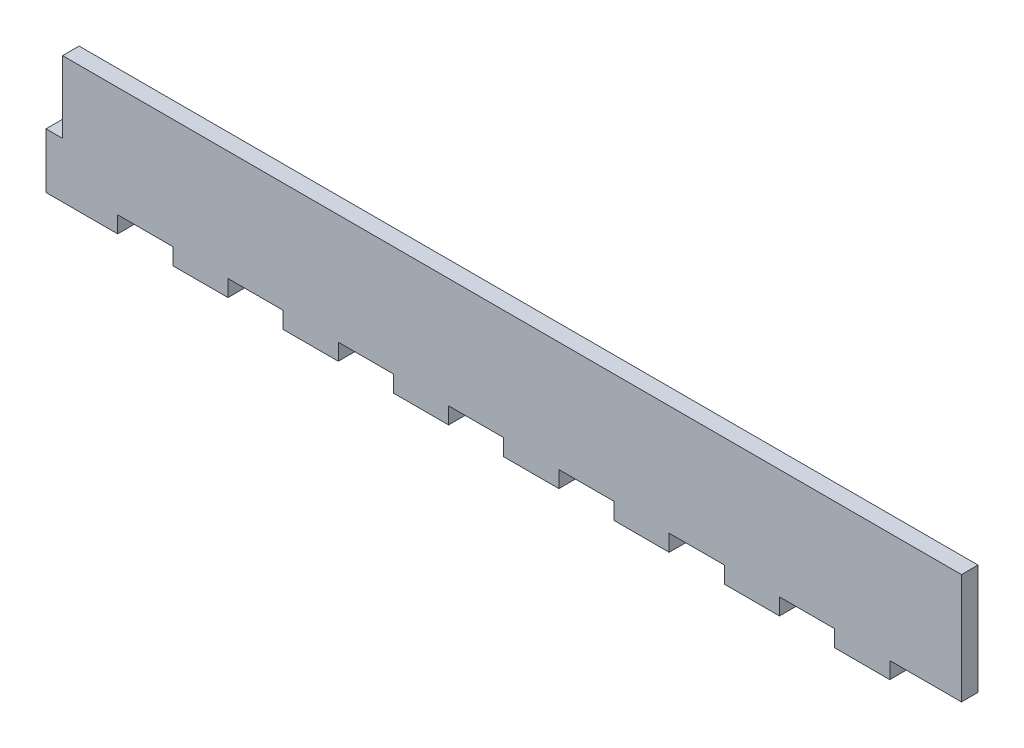
ISO-10303-21;
HEADER;
FILE_DESCRIPTION(('STEP AP214'),'2;1');
FILE_NAME('part.step','',(''),(''),'','','');
FILE_SCHEMA(('AUTOMOTIVE_DESIGN { 1 0 10303 214 1 1 1 1 }'));
ENDSEC;
DATA;
#1=APPLICATION_CONTEXT('core data for automotive mechanical design processes');
#2=APPLICATION_PROTOCOL_DEFINITION('international standard','automotive_design',2000,#1);
#3=PRODUCT_CONTEXT('',#1,'mechanical');
#4=PRODUCT('Part','Part','',(#3));
#5=PRODUCT_RELATED_PRODUCT_CATEGORY('part','',(#4));
#6=PRODUCT_DEFINITION_FORMATION('','',#4);
#7=PRODUCT_DEFINITION_CONTEXT('part definition',#1,'design');
#8=PRODUCT_DEFINITION('design','',#6,#7);
#9=PRODUCT_DEFINITION_SHAPE('','',#8);
#10=(LENGTH_UNIT() NAMED_UNIT(*) SI_UNIT(.MILLI.,.METRE.));
#11=(NAMED_UNIT(*) PLANE_ANGLE_UNIT() SI_UNIT($,.RADIAN.));
#12=(NAMED_UNIT(*) SI_UNIT($,.STERADIAN.) SOLID_ANGLE_UNIT());
#13=UNCERTAINTY_MEASURE_WITH_UNIT(LENGTH_MEASURE(1.E-05),#10,'distance_accuracy_value','');
#14=(GEOMETRIC_REPRESENTATION_CONTEXT(3) GLOBAL_UNCERTAINTY_ASSIGNED_CONTEXT((#13)) GLOBAL_UNIT_ASSIGNED_CONTEXT((#10,
#11,#12)) REPRESENTATION_CONTEXT('',''));
#15=CARTESIAN_POINT('',(0.,0.,0.));
#16=DIRECTION('',(0.,0.,1.));
#17=DIRECTION('',(1.,0.,0.));
#18=AXIS2_PLACEMENT_3D('',#15,#16,#17);
#19=CARTESIAN_POINT('',(0.,0.,3.));
#20=DIRECTION('',(1.,0.,0.));
#21=DIRECTION('',(0.,1.,0.));
#22=AXIS2_PLACEMENT_3D('',#19,#20,#21);
#23=PLANE('',#22);
#24=DIRECTION('',(0.,0.,-1.));
#25=VECTOR('',#24,1.);
#26=CARTESIAN_POINT('',(0.,-13.,0.));
#27=LINE('',#26,#25);
#28=CARTESIAN_POINT('',(0.,-13.,3.));
#29=VERTEX_POINT('',#28);
#30=CARTESIAN_POINT('',(0.,-13.,0.));
#31=VERTEX_POINT('',#30);
#32=EDGE_CURVE('E49',#29,#31,#27,.T.);
#33=ORIENTED_EDGE('',*,*,#32,.F.);
#34=DIRECTION('',(0.,-1.,0.));
#35=VECTOR('',#34,1.);
#36=CARTESIAN_POINT('',(0.,0.,3.));
#37=LINE('',#36,#35);
#38=CARTESIAN_POINT('',(0.,0.,3.));
#39=VERTEX_POINT('',#38);
#40=EDGE_CURVE('E504',#39,#29,#37,.T.);
#41=ORIENTED_EDGE('',*,*,#40,.F.);
#42=DIRECTION('',(0.,0.,-1.));
#43=VECTOR('',#42,1.);
#44=CARTESIAN_POINT('',(0.,0.,3.));
#45=LINE('',#44,#43);
#46=CARTESIAN_POINT('',(0.,0.,0.));
#47=VERTEX_POINT('',#46);
#48=EDGE_CURVE('E515',#39,#47,#45,.T.);
#49=ORIENTED_EDGE('',*,*,#48,.T.);
#50=DIRECTION('',(0.,-1.,0.));
#51=VECTOR('',#50,1.);
#52=CARTESIAN_POINT('',(0.,0.,0.));
#53=LINE('',#52,#51);
#54=EDGE_CURVE('E503',#47,#31,#53,.T.);
#55=ORIENTED_EDGE('',*,*,#54,.T.);
#56=EDGE_LOOP('',(#33,#41,#49,#55));
#57=FACE_BOUND('',#56,.T.);
#58=ADVANCED_FACE('F35',(#57),#23,.F.);
#59=CARTESIAN_POINT('',(0.,-20.,3.));
#60=DIRECTION('',(0.,1.,0.));
#61=DIRECTION('',(0.,0.,1.));
#62=AXIS2_PLACEMENT_3D('',#59,#60,#61);
#63=PLANE('',#62);
#64=DIRECTION('',(0.,0.,-1.));
#65=VECTOR('',#64,1.);
#66=CARTESIAN_POINT('',(140.,-20.,3.));
#67=LINE('',#66,#65);
#68=CARTESIAN_POINT('',(140.,-20.,3.));
#69=VERTEX_POINT('',#68);
#70=CARTESIAN_POINT('',(140.,-20.,0.));
#71=VERTEX_POINT('',#70);
#72=EDGE_CURVE('E307',#69,#71,#67,.T.);
#73=ORIENTED_EDGE('',*,*,#72,.F.);
#74=DIRECTION('',(1.,0.,0.));
#75=VECTOR('',#74,1.);
#76=CARTESIAN_POINT('',(0.,-20.,3.));
#77=LINE('',#76,#75);
#78=CARTESIAN_POINT('',(130.,-20.,3.));
#79=VERTEX_POINT('',#78);
#80=EDGE_CURVE('E583',#79,#69,#77,.T.);
#81=ORIENTED_EDGE('',*,*,#80,.F.);
#82=DIRECTION('',(0.,0.,1.));
#83=VECTOR('',#82,1.);
#84=CARTESIAN_POINT('',(130.,-20.,3.));
#85=LINE('',#84,#83);
#86=CARTESIAN_POINT('',(130.,-20.,0.));
#87=VERTEX_POINT('',#86);
#88=EDGE_CURVE('E338',#87,#79,#85,.T.);
#89=ORIENTED_EDGE('',*,*,#88,.F.);
#90=DIRECTION('',(1.,0.,0.));
#91=VECTOR('',#90,1.);
#92=CARTESIAN_POINT('',(0.,-20.,0.));
#93=LINE('',#92,#91);
#94=EDGE_CURVE('E543',#87,#71,#93,.T.);
#95=ORIENTED_EDGE('',*,*,#94,.T.);
#96=EDGE_LOOP('',(#73,#81,#89,#95));
#97=FACE_BOUND('',#96,.T.);
#98=ADVANCED_FACE('F602',(#97),#63,.F.);
#99=DIRECTION('',(0.,0.,1.));
#100=VECTOR('',#99,1.);
#101=CARTESIAN_POINT('',(150.,-20.,3.));
#102=LINE('',#101,#100);
#103=CARTESIAN_POINT('',(150.,-20.,0.));
#104=VERTEX_POINT('',#103);
#105=CARTESIAN_POINT('',(150.,-20.,3.));
#106=VERTEX_POINT('',#105);
#107=EDGE_CURVE('E312',#104,#106,#102,.T.);
#108=ORIENTED_EDGE('',*,*,#107,.F.);
#109=CARTESIAN_POINT('',(163.,-20.,0.));
#110=VERTEX_POINT('',#109);
#111=EDGE_CURVE('E517',#104,#110,#93,.T.);
#112=ORIENTED_EDGE('',*,*,#111,.T.);
#113=DIRECTION('',(0.,0.,-1.));
#114=VECTOR('',#113,1.);
#115=CARTESIAN_POINT('',(163.,-20.,3.));
#116=LINE('',#115,#114);
#117=CARTESIAN_POINT('',(163.,-20.,3.));
#118=VERTEX_POINT('',#117);
#119=EDGE_CURVE('E11',#118,#110,#116,.T.);
#120=ORIENTED_EDGE('',*,*,#119,.F.);
#121=EDGE_CURVE('E57',#106,#118,#77,.T.);
#122=ORIENTED_EDGE('',*,*,#121,.F.);
#123=EDGE_LOOP('',(#108,#112,#120,#122));
#124=FACE_BOUND('',#123,.T.);
#125=ADVANCED_FACE('F541',(#124),#63,.F.);
#126=DIRECTION('',(0.,0.,-1.));
#127=VECTOR('',#126,1.);
#128=CARTESIAN_POINT('',(120.,-20.,3.));
#129=LINE('',#128,#127);
#130=CARTESIAN_POINT('',(120.,-20.,3.));
#131=VERTEX_POINT('',#130);
#132=CARTESIAN_POINT('',(120.,-20.,0.));
#133=VERTEX_POINT('',#132);
#134=EDGE_CURVE('E333',#131,#133,#129,.T.);
#135=ORIENTED_EDGE('',*,*,#134,.F.);
#136=CARTESIAN_POINT('',(110.,-20.,3.));
#137=VERTEX_POINT('',#136);
#138=EDGE_CURVE('E580',#137,#131,#77,.T.);
#139=ORIENTED_EDGE('',*,*,#138,.F.);
#140=DIRECTION('',(0.,0.,1.));
#141=VECTOR('',#140,1.);
#142=CARTESIAN_POINT('',(110.,-20.,3.));
#143=LINE('',#142,#141);
#144=CARTESIAN_POINT('',(110.,-20.,0.));
#145=VERTEX_POINT('',#144);
#146=EDGE_CURVE('E365',#145,#137,#143,.T.);
#147=ORIENTED_EDGE('',*,*,#146,.F.);
#148=EDGE_CURVE('E544',#145,#133,#93,.T.);
#149=ORIENTED_EDGE('',*,*,#148,.T.);
#150=EDGE_LOOP('',(#135,#139,#147,#149));
#151=FACE_BOUND('',#150,.T.);
#152=ADVANCED_FACE('F612',(#151),#63,.F.);
#153=DIRECTION('',(0.,0.,-1.));
#154=VECTOR('',#153,1.);
#155=CARTESIAN_POINT('',(100.,-20.,3.));
#156=LINE('',#155,#154);
#157=CARTESIAN_POINT('',(100.,-20.,3.));
#158=VERTEX_POINT('',#157);
#159=CARTESIAN_POINT('',(100.,-20.,0.));
#160=VERTEX_POINT('',#159);
#161=EDGE_CURVE('E360',#158,#160,#156,.T.);
#162=ORIENTED_EDGE('',*,*,#161,.F.);
#163=CARTESIAN_POINT('',(90.,-20.,3.));
#164=VERTEX_POINT('',#163);
#165=EDGE_CURVE('E577',#164,#158,#77,.T.);
#166=ORIENTED_EDGE('',*,*,#165,.F.);
#167=DIRECTION('',(0.,0.,1.));
#168=VECTOR('',#167,1.);
#169=CARTESIAN_POINT('',(90.,-20.,3.));
#170=LINE('',#169,#168);
#171=CARTESIAN_POINT('',(90.,-20.,0.));
#172=VERTEX_POINT('',#171);
#173=EDGE_CURVE('E392',#172,#164,#170,.T.);
#174=ORIENTED_EDGE('',*,*,#173,.F.);
#175=EDGE_CURVE('E547',#172,#160,#93,.T.);
#176=ORIENTED_EDGE('',*,*,#175,.T.);
#177=EDGE_LOOP('',(#162,#166,#174,#176));
#178=FACE_BOUND('',#177,.T.);
#179=ADVANCED_FACE('F625',(#178),#63,.F.);
#180=DIRECTION('',(0.,0.,-1.));
#181=VECTOR('',#180,1.);
#182=CARTESIAN_POINT('',(80.,-20.,3.));
#183=LINE('',#182,#181);
#184=CARTESIAN_POINT('',(80.,-20.,3.));
#185=VERTEX_POINT('',#184);
#186=CARTESIAN_POINT('',(80.,-20.,0.));
#187=VERTEX_POINT('',#186);
#188=EDGE_CURVE('E387',#185,#187,#183,.T.);
#189=ORIENTED_EDGE('',*,*,#188,.F.);
#190=CARTESIAN_POINT('',(70.,-20.,3.));
#191=VERTEX_POINT('',#190);
#192=EDGE_CURVE('E574',#191,#185,#77,.T.);
#193=ORIENTED_EDGE('',*,*,#192,.F.);
#194=DIRECTION('',(0.,0.,1.));
#195=VECTOR('',#194,1.);
#196=CARTESIAN_POINT('',(70.,-20.,3.));
#197=LINE('',#196,#195);
#198=CARTESIAN_POINT('',(70.,-20.,0.));
#199=VERTEX_POINT('',#198);
#200=EDGE_CURVE('E419',#199,#191,#197,.T.);
#201=ORIENTED_EDGE('',*,*,#200,.F.);
#202=EDGE_CURVE('E550',#199,#187,#93,.T.);
#203=ORIENTED_EDGE('',*,*,#202,.T.);
#204=EDGE_LOOP('',(#189,#193,#201,#203));
#205=FACE_BOUND('',#204,.T.);
#206=ADVANCED_FACE('F638',(#205),#63,.F.);
#207=DIRECTION('',(0.,0.,-1.));
#208=VECTOR('',#207,1.);
#209=CARTESIAN_POINT('',(60.,-20.,3.));
#210=LINE('',#209,#208);
#211=CARTESIAN_POINT('',(60.,-20.,3.));
#212=VERTEX_POINT('',#211);
#213=CARTESIAN_POINT('',(60.,-20.,0.));
#214=VERTEX_POINT('',#213);
#215=EDGE_CURVE('E414',#212,#214,#210,.T.);
#216=ORIENTED_EDGE('',*,*,#215,.F.);
#217=CARTESIAN_POINT('',(50.,-20.,3.));
#218=VERTEX_POINT('',#217);
#219=EDGE_CURVE('E572',#218,#212,#77,.T.);
#220=ORIENTED_EDGE('',*,*,#219,.F.);
#221=DIRECTION('',(0.,0.,1.));
#222=VECTOR('',#221,1.);
#223=CARTESIAN_POINT('',(50.,-20.,3.));
#224=LINE('',#223,#222);
#225=CARTESIAN_POINT('',(50.,-20.,0.));
#226=VERTEX_POINT('',#225);
#227=EDGE_CURVE('E446',#226,#218,#224,.T.);
#228=ORIENTED_EDGE('',*,*,#227,.F.);
#229=EDGE_CURVE('E553',#226,#214,#93,.T.);
#230=ORIENTED_EDGE('',*,*,#229,.T.);
#231=EDGE_LOOP('',(#216,#220,#228,#230));
#232=FACE_BOUND('',#231,.T.);
#233=ADVANCED_FACE('F650',(#232),#63,.F.);
#234=DIRECTION('',(0.,0.,-1.));
#235=VECTOR('',#234,1.);
#236=CARTESIAN_POINT('',(40.,-20.,3.));
#237=LINE('',#236,#235);
#238=CARTESIAN_POINT('',(40.,-20.,3.));
#239=VERTEX_POINT('',#238);
#240=CARTESIAN_POINT('',(40.,-20.,0.));
#241=VERTEX_POINT('',#240);
#242=EDGE_CURVE('E441',#239,#241,#237,.T.);
#243=ORIENTED_EDGE('',*,*,#242,.F.);
#244=CARTESIAN_POINT('',(30.,-20.,3.));
#245=VERTEX_POINT('',#244);
#246=EDGE_CURVE('E511',#245,#239,#77,.T.);
#247=ORIENTED_EDGE('',*,*,#246,.F.);
#248=DIRECTION('',(0.,0.,1.));
#249=VECTOR('',#248,1.);
#250=CARTESIAN_POINT('',(30.,-20.,3.));
#251=LINE('',#250,#249);
#252=CARTESIAN_POINT('',(30.,-20.,0.));
#253=VERTEX_POINT('',#252);
#254=EDGE_CURVE('E473',#253,#245,#251,.T.);
#255=ORIENTED_EDGE('',*,*,#254,.F.);
#256=EDGE_CURVE('E521',#253,#241,#93,.T.);
#257=ORIENTED_EDGE('',*,*,#256,.T.);
#258=EDGE_LOOP('',(#243,#247,#255,#257));
#259=FACE_BOUND('',#258,.T.);
#260=ADVANCED_FACE('F560',(#259),#63,.F.);
#261=DIRECTION('',(0.,0.,-1.));
#262=VECTOR('',#261,1.);
#263=CARTESIAN_POINT('',(20.,-20.,3.));
#264=LINE('',#263,#262);
#265=CARTESIAN_POINT('',(20.,-20.,3.));
#266=VERTEX_POINT('',#265);
#267=CARTESIAN_POINT('',(20.,-20.,0.));
#268=VERTEX_POINT('',#267);
#269=EDGE_CURVE('E468',#266,#268,#264,.T.);
#270=ORIENTED_EDGE('',*,*,#269,.F.);
#271=CARTESIAN_POINT('',(10.,-20.,3.));
#272=VERTEX_POINT('',#271);
#273=EDGE_CURVE('E507',#272,#266,#77,.T.);
#274=ORIENTED_EDGE('',*,*,#273,.F.);
#275=DIRECTION('',(0.,0.,1.));
#276=VECTOR('',#275,1.);
#277=CARTESIAN_POINT('',(10.,-20.,3.));
#278=LINE('',#277,#276);
#279=CARTESIAN_POINT('',(10.,-20.,0.));
#280=VERTEX_POINT('',#279);
#281=EDGE_CURVE('E282',#280,#272,#278,.T.);
#282=ORIENTED_EDGE('',*,*,#281,.F.);
#283=EDGE_CURVE('E518',#280,#268,#93,.T.);
#284=ORIENTED_EDGE('',*,*,#283,.T.);
#285=EDGE_LOOP('',(#270,#274,#282,#284));
#286=FACE_BOUND('',#285,.T.);
#287=ADVANCED_FACE('F671',(#286),#63,.F.);
#288=CARTESIAN_POINT('',(163.,0.,3.));
#289=DIRECTION('',(-1.,0.,0.));
#290=DIRECTION('',(0.,0.,1.));
#291=AXIS2_PLACEMENT_3D('',#288,#289,#290);
#292=PLANE('',#291);
#293=DIRECTION('',(0.,1.,0.));
#294=VECTOR('',#293,1.);
#295=CARTESIAN_POINT('',(163.,0.,0.));
#296=LINE('',#295,#294);
#297=CARTESIAN_POINT('',(163.,0.,0.));
#298=VERTEX_POINT('',#297);
#299=EDGE_CURVE('E520',#110,#298,#296,.T.);
#300=ORIENTED_EDGE('',*,*,#299,.T.);
#301=DIRECTION('',(0.,0.,-1.));
#302=VECTOR('',#301,1.);
#303=CARTESIAN_POINT('',(163.,0.,3.));
#304=LINE('',#303,#302);
#305=CARTESIAN_POINT('',(163.,0.,3.));
#306=VERTEX_POINT('',#305);
#307=EDGE_CURVE('E42',#306,#298,#304,.T.);
#308=ORIENTED_EDGE('',*,*,#307,.F.);
#309=DIRECTION('',(0.,1.,0.));
#310=VECTOR('',#309,1.);
#311=CARTESIAN_POINT('',(163.,0.,3.));
#312=LINE('',#311,#310);
#313=EDGE_CURVE('E510',#118,#306,#312,.T.);
#314=ORIENTED_EDGE('',*,*,#313,.F.);
#315=ORIENTED_EDGE('',*,*,#119,.T.);
#316=EDGE_LOOP('',(#300,#308,#314,#315));
#317=FACE_BOUND('',#316,.T.);
#318=ADVANCED_FACE('F540',(#317),#292,.F.);
#319=CARTESIAN_POINT('',(0.,0.,3.));
#320=DIRECTION('',(0.,-1.,0.));
#321=DIRECTION('',(0.,0.,-1.));
#322=AXIS2_PLACEMENT_3D('',#319,#320,#321);
#323=PLANE('',#322);
#324=DIRECTION('',(-1.,0.,0.));
#325=VECTOR('',#324,1.);
#326=CARTESIAN_POINT('',(0.,0.,0.));
#327=LINE('',#326,#325);
#328=EDGE_CURVE('E506',#298,#47,#327,.T.);
#329=ORIENTED_EDGE('',*,*,#328,.T.);
#330=ORIENTED_EDGE('',*,*,#48,.F.);
#331=DIRECTION('',(-1.,0.,0.));
#332=VECTOR('',#331,1.);
#333=CARTESIAN_POINT('',(0.,0.,3.));
#334=LINE('',#333,#332);
#335=EDGE_CURVE('E513',#306,#39,#334,.T.);
#336=ORIENTED_EDGE('',*,*,#335,.F.);
#337=ORIENTED_EDGE('',*,*,#307,.T.);
#338=EDGE_LOOP('',(#329,#330,#336,#337));
#339=FACE_BOUND('',#338,.T.);
#340=ADVANCED_FACE('F530',(#339),#323,.F.);
#341=CARTESIAN_POINT('',(0.,0.,3.));
#342=DIRECTION('',(0.,0.,1.));
#343=DIRECTION('',(1.,0.,0.));
#344=AXIS2_PLACEMENT_3D('',#341,#342,#343);
#345=PLANE('',#344);
#346=ORIENTED_EDGE('',*,*,#40,.T.);
#347=DIRECTION('',(1.,0.,0.));
#348=VECTOR('',#347,1.);
#349=CARTESIAN_POINT('',(-3.,-13.,3.));
#350=LINE('',#349,#348);
#351=CARTESIAN_POINT('',(-3.,-13.,3.));
#352=VERTEX_POINT('',#351);
#353=EDGE_CURVE('E304',#352,#29,#350,.T.);
#354=ORIENTED_EDGE('',*,*,#353,.F.);
#355=DIRECTION('',(0.,1.,0.));
#356=VECTOR('',#355,1.);
#357=CARTESIAN_POINT('',(-3.,-23.,3.));
#358=LINE('',#357,#356);
#359=CARTESIAN_POINT('',(-3.,-23.,3.));
#360=VERTEX_POINT('',#359);
#361=EDGE_CURVE('E291',#360,#352,#358,.T.);
#362=ORIENTED_EDGE('',*,*,#361,.F.);
#363=DIRECTION('',(-1.,0.,0.));
#364=VECTOR('',#363,1.);
#365=CARTESIAN_POINT('',(0.,-23.,3.));
#366=LINE('',#365,#364);
#367=CARTESIAN_POINT('',(10.,-23.,3.));
#368=VERTEX_POINT('',#367);
#369=EDGE_CURVE('E288',#368,#360,#366,.T.);
#370=ORIENTED_EDGE('',*,*,#369,.F.);
#371=DIRECTION('',(0.,1.,0.));
#372=VECTOR('',#371,1.);
#373=CARTESIAN_POINT('',(10.,-23.,3.));
#374=LINE('',#373,#372);
#375=EDGE_CURVE('E497',#368,#272,#374,.T.);
#376=ORIENTED_EDGE('',*,*,#375,.T.);
#377=ORIENTED_EDGE('',*,*,#273,.T.);
#378=DIRECTION('',(0.,1.,0.));
#379=VECTOR('',#378,1.);
#380=CARTESIAN_POINT('',(20.,-23.,3.));
#381=LINE('',#380,#379);
#382=CARTESIAN_POINT('',(20.,-23.,3.));
#383=VERTEX_POINT('',#382);
#384=EDGE_CURVE('E479',#383,#266,#381,.T.);
#385=ORIENTED_EDGE('',*,*,#384,.F.);
#386=DIRECTION('',(-1.,0.,0.));
#387=VECTOR('',#386,1.);
#388=CARTESIAN_POINT('',(20.,-23.,3.));
#389=LINE('',#388,#387);
#390=CARTESIAN_POINT('',(30.,-23.,3.));
#391=VERTEX_POINT('',#390);
#392=EDGE_CURVE('E477',#391,#383,#389,.T.);
#393=ORIENTED_EDGE('',*,*,#392,.F.);
#394=DIRECTION('',(0.,1.,0.));
#395=VECTOR('',#394,1.);
#396=CARTESIAN_POINT('',(30.,-23.,3.));
#397=LINE('',#396,#395);
#398=EDGE_CURVE('E486',#391,#245,#397,.T.);
#399=ORIENTED_EDGE('',*,*,#398,.T.);
#400=ORIENTED_EDGE('',*,*,#246,.T.);
#401=DIRECTION('',(0.,1.,0.));
#402=VECTOR('',#401,1.);
#403=CARTESIAN_POINT('',(40.,-23.,3.));
#404=LINE('',#403,#402);
#405=CARTESIAN_POINT('',(40.,-23.,3.));
#406=VERTEX_POINT('',#405);
#407=EDGE_CURVE('E452',#406,#239,#404,.T.);
#408=ORIENTED_EDGE('',*,*,#407,.F.);
#409=DIRECTION('',(-1.,0.,0.));
#410=VECTOR('',#409,1.);
#411=CARTESIAN_POINT('',(40.,-23.,3.));
#412=LINE('',#411,#410);
#413=CARTESIAN_POINT('',(50.,-23.,3.));
#414=VERTEX_POINT('',#413);
#415=EDGE_CURVE('E450',#414,#406,#412,.T.);
#416=ORIENTED_EDGE('',*,*,#415,.F.);
#417=DIRECTION('',(0.,1.,0.));
#418=VECTOR('',#417,1.);
#419=CARTESIAN_POINT('',(50.,-23.,3.));
#420=LINE('',#419,#418);
#421=EDGE_CURVE('E459',#414,#218,#420,.T.);
#422=ORIENTED_EDGE('',*,*,#421,.T.);
#423=ORIENTED_EDGE('',*,*,#219,.T.);
#424=DIRECTION('',(0.,1.,0.));
#425=VECTOR('',#424,1.);
#426=CARTESIAN_POINT('',(60.,-23.,3.));
#427=LINE('',#426,#425);
#428=CARTESIAN_POINT('',(60.,-23.,3.));
#429=VERTEX_POINT('',#428);
#430=EDGE_CURVE('E425',#429,#212,#427,.T.);
#431=ORIENTED_EDGE('',*,*,#430,.F.);
#432=DIRECTION('',(-1.,0.,0.));
#433=VECTOR('',#432,1.);
#434=CARTESIAN_POINT('',(60.,-23.,3.));
#435=LINE('',#434,#433);
#436=CARTESIAN_POINT('',(70.,-23.,3.));
#437=VERTEX_POINT('',#436);
#438=EDGE_CURVE('E423',#437,#429,#435,.T.);
#439=ORIENTED_EDGE('',*,*,#438,.F.);
#440=DIRECTION('',(0.,1.,0.));
#441=VECTOR('',#440,1.);
#442=CARTESIAN_POINT('',(70.,-23.,3.));
#443=LINE('',#442,#441);
#444=EDGE_CURVE('E432',#437,#191,#443,.T.);
#445=ORIENTED_EDGE('',*,*,#444,.T.);
#446=ORIENTED_EDGE('',*,*,#192,.T.);
#447=DIRECTION('',(0.,1.,0.));
#448=VECTOR('',#447,1.);
#449=CARTESIAN_POINT('',(80.,-23.,3.));
#450=LINE('',#449,#448);
#451=CARTESIAN_POINT('',(80.,-23.,3.));
#452=VERTEX_POINT('',#451);
#453=EDGE_CURVE('E398',#452,#185,#450,.T.);
#454=ORIENTED_EDGE('',*,*,#453,.F.);
#455=DIRECTION('',(-1.,0.,0.));
#456=VECTOR('',#455,1.);
#457=CARTESIAN_POINT('',(80.,-23.,3.));
#458=LINE('',#457,#456);
#459=CARTESIAN_POINT('',(90.,-23.,3.));
#460=VERTEX_POINT('',#459);
#461=EDGE_CURVE('E396',#460,#452,#458,.T.);
#462=ORIENTED_EDGE('',*,*,#461,.F.);
#463=DIRECTION('',(0.,1.,0.));
#464=VECTOR('',#463,1.);
#465=CARTESIAN_POINT('',(90.,-23.,3.));
#466=LINE('',#465,#464);
#467=EDGE_CURVE('E405',#460,#164,#466,.T.);
#468=ORIENTED_EDGE('',*,*,#467,.T.);
#469=ORIENTED_EDGE('',*,*,#165,.T.);
#470=DIRECTION('',(0.,1.,0.));
#471=VECTOR('',#470,1.);
#472=CARTESIAN_POINT('',(100.,-23.,3.));
#473=LINE('',#472,#471);
#474=CARTESIAN_POINT('',(100.,-23.,3.));
#475=VERTEX_POINT('',#474);
#476=EDGE_CURVE('E371',#475,#158,#473,.T.);
#477=ORIENTED_EDGE('',*,*,#476,.F.);
#478=DIRECTION('',(-1.,0.,0.));
#479=VECTOR('',#478,1.);
#480=CARTESIAN_POINT('',(100.,-23.,3.));
#481=LINE('',#480,#479);
#482=CARTESIAN_POINT('',(110.,-23.,3.));
#483=VERTEX_POINT('',#482);
#484=EDGE_CURVE('E369',#483,#475,#481,.T.);
#485=ORIENTED_EDGE('',*,*,#484,.F.);
#486=DIRECTION('',(0.,1.,0.));
#487=VECTOR('',#486,1.);
#488=CARTESIAN_POINT('',(110.,-23.,3.));
#489=LINE('',#488,#487);
#490=EDGE_CURVE('E378',#483,#137,#489,.T.);
#491=ORIENTED_EDGE('',*,*,#490,.T.);
#492=ORIENTED_EDGE('',*,*,#138,.T.);
#493=DIRECTION('',(0.,1.,0.));
#494=VECTOR('',#493,1.);
#495=CARTESIAN_POINT('',(120.,-23.,3.));
#496=LINE('',#495,#494);
#497=CARTESIAN_POINT('',(120.,-23.,3.));
#498=VERTEX_POINT('',#497);
#499=EDGE_CURVE('E344',#498,#131,#496,.T.);
#500=ORIENTED_EDGE('',*,*,#499,.F.);
#501=DIRECTION('',(-1.,0.,0.));
#502=VECTOR('',#501,1.);
#503=CARTESIAN_POINT('',(120.,-23.,3.));
#504=LINE('',#503,#502);
#505=CARTESIAN_POINT('',(130.,-23.,3.));
#506=VERTEX_POINT('',#505);
#507=EDGE_CURVE('E342',#506,#498,#504,.T.);
#508=ORIENTED_EDGE('',*,*,#507,.F.);
#509=DIRECTION('',(0.,1.,0.));
#510=VECTOR('',#509,1.);
#511=CARTESIAN_POINT('',(130.,-23.,3.));
#512=LINE('',#511,#510);
#513=EDGE_CURVE('E351',#506,#79,#512,.T.);
#514=ORIENTED_EDGE('',*,*,#513,.T.);
#515=ORIENTED_EDGE('',*,*,#80,.T.);
#516=DIRECTION('',(0.,1.,0.));
#517=VECTOR('',#516,1.);
#518=CARTESIAN_POINT('',(140.,-23.,3.));
#519=LINE('',#518,#517);
#520=CARTESIAN_POINT('',(140.,-23.,3.));
#521=VERTEX_POINT('',#520);
#522=EDGE_CURVE('E318',#521,#69,#519,.T.);
#523=ORIENTED_EDGE('',*,*,#522,.F.);
#524=DIRECTION('',(-1.,0.,0.));
#525=VECTOR('',#524,1.);
#526=CARTESIAN_POINT('',(140.,-23.,3.));
#527=LINE('',#526,#525);
#528=CARTESIAN_POINT('',(150.,-23.,3.));
#529=VERTEX_POINT('',#528);
#530=EDGE_CURVE('E316',#529,#521,#527,.T.);
#531=ORIENTED_EDGE('',*,*,#530,.F.);
#532=DIRECTION('',(0.,1.,0.));
#533=VECTOR('',#532,1.);
#534=CARTESIAN_POINT('',(150.,-23.,3.));
#535=LINE('',#534,#533);
#536=EDGE_CURVE('E324',#529,#106,#535,.T.);
#537=ORIENTED_EDGE('',*,*,#536,.T.);
#538=ORIENTED_EDGE('',*,*,#121,.T.);
#539=ORIENTED_EDGE('',*,*,#313,.T.);
#540=ORIENTED_EDGE('',*,*,#335,.T.);
#541=EDGE_LOOP('',(#346,#354,#362,#370,#376,#377,#385,#393,#399,#400,#408,#416,#422,#423,#431,
#439,#445,#446,#454,#462,#468,#469,#477,#485,#491,#492,#500,#508,#514,#515,#523,#531,#537,#538,
#539,#540));
#542=FACE_BOUND('',#541,.T.);
#543=ADVANCED_FACE('F539',(#542),#345,.T.);
#544=CARTESIAN_POINT('',(0.,0.,0.));
#545=DIRECTION('',(0.,0.,1.));
#546=DIRECTION('',(1.,0.,0.));
#547=AXIS2_PLACEMENT_3D('',#544,#545,#546);
#548=PLANE('',#547);
#549=ORIENTED_EDGE('',*,*,#54,.F.);
#550=ORIENTED_EDGE('',*,*,#328,.F.);
#551=ORIENTED_EDGE('',*,*,#299,.F.);
#552=ORIENTED_EDGE('',*,*,#111,.F.);
#553=DIRECTION('',(0.,1.,0.));
#554=VECTOR('',#553,1.);
#555=CARTESIAN_POINT('',(150.,-23.,0.));
#556=LINE('',#555,#554);
#557=CARTESIAN_POINT('',(150.,-23.,0.));
#558=VERTEX_POINT('',#557);
#559=EDGE_CURVE('E327',#558,#104,#556,.T.);
#560=ORIENTED_EDGE('',*,*,#559,.F.);
#561=DIRECTION('',(1.,0.,0.));
#562=VECTOR('',#561,1.);
#563=CARTESIAN_POINT('',(140.,-23.,0.));
#564=LINE('',#563,#562);
#565=CARTESIAN_POINT('',(140.,-23.,0.));
#566=VERTEX_POINT('',#565);
#567=EDGE_CURVE('E311',#566,#558,#564,.T.);
#568=ORIENTED_EDGE('',*,*,#567,.F.);
#569=DIRECTION('',(0.,1.,0.));
#570=VECTOR('',#569,1.);
#571=CARTESIAN_POINT('',(140.,-23.,0.));
#572=LINE('',#571,#570);
#573=EDGE_CURVE('E330',#566,#71,#572,.T.);
#574=ORIENTED_EDGE('',*,*,#573,.T.);
#575=ORIENTED_EDGE('',*,*,#94,.F.);
#576=DIRECTION('',(0.,1.,0.));
#577=VECTOR('',#576,1.);
#578=CARTESIAN_POINT('',(130.,-23.,0.));
#579=LINE('',#578,#577);
#580=CARTESIAN_POINT('',(130.,-23.,0.));
#581=VERTEX_POINT('',#580);
#582=EDGE_CURVE('E354',#581,#87,#579,.T.);
#583=ORIENTED_EDGE('',*,*,#582,.F.);
#584=DIRECTION('',(1.,0.,0.));
#585=VECTOR('',#584,1.);
#586=CARTESIAN_POINT('',(120.,-23.,0.));
#587=LINE('',#586,#585);
#588=CARTESIAN_POINT('',(120.,-23.,0.));
#589=VERTEX_POINT('',#588);
#590=EDGE_CURVE('E337',#589,#581,#587,.T.);
#591=ORIENTED_EDGE('',*,*,#590,.F.);
#592=DIRECTION('',(0.,1.,0.));
#593=VECTOR('',#592,1.);
#594=CARTESIAN_POINT('',(120.,-23.,0.));
#595=LINE('',#594,#593);
#596=EDGE_CURVE('E357',#589,#133,#595,.T.);
#597=ORIENTED_EDGE('',*,*,#596,.T.);
#598=ORIENTED_EDGE('',*,*,#148,.F.);
#599=DIRECTION('',(0.,1.,0.));
#600=VECTOR('',#599,1.);
#601=CARTESIAN_POINT('',(110.,-23.,0.));
#602=LINE('',#601,#600);
#603=CARTESIAN_POINT('',(110.,-23.,0.));
#604=VERTEX_POINT('',#603);
#605=EDGE_CURVE('E381',#604,#145,#602,.T.);
#606=ORIENTED_EDGE('',*,*,#605,.F.);
#607=DIRECTION('',(1.,0.,0.));
#608=VECTOR('',#607,1.);
#609=CARTESIAN_POINT('',(100.,-23.,0.));
#610=LINE('',#609,#608);
#611=CARTESIAN_POINT('',(100.,-23.,0.));
#612=VERTEX_POINT('',#611);
#613=EDGE_CURVE('E364',#612,#604,#610,.T.);
#614=ORIENTED_EDGE('',*,*,#613,.F.);
#615=DIRECTION('',(0.,1.,0.));
#616=VECTOR('',#615,1.);
#617=CARTESIAN_POINT('',(100.,-23.,0.));
#618=LINE('',#617,#616);
#619=EDGE_CURVE('E384',#612,#160,#618,.T.);
#620=ORIENTED_EDGE('',*,*,#619,.T.);
#621=ORIENTED_EDGE('',*,*,#175,.F.);
#622=DIRECTION('',(0.,1.,0.));
#623=VECTOR('',#622,1.);
#624=CARTESIAN_POINT('',(90.,-23.,0.));
#625=LINE('',#624,#623);
#626=CARTESIAN_POINT('',(90.,-23.,0.));
#627=VERTEX_POINT('',#626);
#628=EDGE_CURVE('E408',#627,#172,#625,.T.);
#629=ORIENTED_EDGE('',*,*,#628,.F.);
#630=DIRECTION('',(1.,0.,0.));
#631=VECTOR('',#630,1.);
#632=CARTESIAN_POINT('',(80.,-23.,0.));
#633=LINE('',#632,#631);
#634=CARTESIAN_POINT('',(80.,-23.,0.));
#635=VERTEX_POINT('',#634);
#636=EDGE_CURVE('E391',#635,#627,#633,.T.);
#637=ORIENTED_EDGE('',*,*,#636,.F.);
#638=DIRECTION('',(0.,1.,0.));
#639=VECTOR('',#638,1.);
#640=CARTESIAN_POINT('',(80.,-23.,0.));
#641=LINE('',#640,#639);
#642=EDGE_CURVE('E411',#635,#187,#641,.T.);
#643=ORIENTED_EDGE('',*,*,#642,.T.);
#644=ORIENTED_EDGE('',*,*,#202,.F.);
#645=DIRECTION('',(0.,1.,0.));
#646=VECTOR('',#645,1.);
#647=CARTESIAN_POINT('',(70.,-23.,0.));
#648=LINE('',#647,#646);
#649=CARTESIAN_POINT('',(70.,-23.,0.));
#650=VERTEX_POINT('',#649);
#651=EDGE_CURVE('E435',#650,#199,#648,.T.);
#652=ORIENTED_EDGE('',*,*,#651,.F.);
#653=DIRECTION('',(1.,0.,0.));
#654=VECTOR('',#653,1.);
#655=CARTESIAN_POINT('',(60.,-23.,0.));
#656=LINE('',#655,#654);
#657=CARTESIAN_POINT('',(60.,-23.,0.));
#658=VERTEX_POINT('',#657);
#659=EDGE_CURVE('E418',#658,#650,#656,.T.);
#660=ORIENTED_EDGE('',*,*,#659,.F.);
#661=DIRECTION('',(0.,1.,0.));
#662=VECTOR('',#661,1.);
#663=CARTESIAN_POINT('',(60.,-23.,0.));
#664=LINE('',#663,#662);
#665=EDGE_CURVE('E438',#658,#214,#664,.T.);
#666=ORIENTED_EDGE('',*,*,#665,.T.);
#667=ORIENTED_EDGE('',*,*,#229,.F.);
#668=DIRECTION('',(0.,1.,0.));
#669=VECTOR('',#668,1.);
#670=CARTESIAN_POINT('',(50.,-23.,0.));
#671=LINE('',#670,#669);
#672=CARTESIAN_POINT('',(50.,-23.,0.));
#673=VERTEX_POINT('',#672);
#674=EDGE_CURVE('E462',#673,#226,#671,.T.);
#675=ORIENTED_EDGE('',*,*,#674,.F.);
#676=DIRECTION('',(1.,0.,0.));
#677=VECTOR('',#676,1.);
#678=CARTESIAN_POINT('',(40.,-23.,0.));
#679=LINE('',#678,#677);
#680=CARTESIAN_POINT('',(40.,-23.,0.));
#681=VERTEX_POINT('',#680);
#682=EDGE_CURVE('E445',#681,#673,#679,.T.);
#683=ORIENTED_EDGE('',*,*,#682,.F.);
#684=DIRECTION('',(0.,1.,0.));
#685=VECTOR('',#684,1.);
#686=CARTESIAN_POINT('',(40.,-23.,0.));
#687=LINE('',#686,#685);
#688=EDGE_CURVE('E465',#681,#241,#687,.T.);
#689=ORIENTED_EDGE('',*,*,#688,.T.);
#690=ORIENTED_EDGE('',*,*,#256,.F.);
#691=DIRECTION('',(0.,1.,0.));
#692=VECTOR('',#691,1.);
#693=CARTESIAN_POINT('',(30.,-23.,0.));
#694=LINE('',#693,#692);
#695=CARTESIAN_POINT('',(30.,-23.,0.));
#696=VERTEX_POINT('',#695);
#697=EDGE_CURVE('E489',#696,#253,#694,.T.);
#698=ORIENTED_EDGE('',*,*,#697,.F.);
#699=DIRECTION('',(1.,0.,0.));
#700=VECTOR('',#699,1.);
#701=CARTESIAN_POINT('',(20.,-23.,0.));
#702=LINE('',#701,#700);
#703=CARTESIAN_POINT('',(20.,-23.,0.));
#704=VERTEX_POINT('',#703);
#705=EDGE_CURVE('E472',#704,#696,#702,.T.);
#706=ORIENTED_EDGE('',*,*,#705,.F.);
#707=DIRECTION('',(0.,1.,0.));
#708=VECTOR('',#707,1.);
#709=CARTESIAN_POINT('',(20.,-23.,0.));
#710=LINE('',#709,#708);
#711=EDGE_CURVE('E492',#704,#268,#710,.T.);
#712=ORIENTED_EDGE('',*,*,#711,.T.);
#713=ORIENTED_EDGE('',*,*,#283,.F.);
#714=DIRECTION('',(0.,1.,0.));
#715=VECTOR('',#714,1.);
#716=CARTESIAN_POINT('',(10.,-23.,0.));
#717=LINE('',#716,#715);
#718=CARTESIAN_POINT('',(10.,-23.,0.));
#719=VERTEX_POINT('',#718);
#720=EDGE_CURVE('E278',#719,#280,#717,.T.);
#721=ORIENTED_EDGE('',*,*,#720,.F.);
#722=DIRECTION('',(1.,0.,0.));
#723=VECTOR('',#722,1.);
#724=CARTESIAN_POINT('',(0.,-23.,0.));
#725=LINE('',#724,#723);
#726=CARTESIAN_POINT('',(-3.,-23.,0.));
#727=VERTEX_POINT('',#726);
#728=EDGE_CURVE('E269',#727,#719,#725,.T.);
#729=ORIENTED_EDGE('',*,*,#728,.F.);
#730=DIRECTION('',(0.,-1.,0.));
#731=VECTOR('',#730,1.);
#732=CARTESIAN_POINT('',(-3.,-23.,0.));
#733=LINE('',#732,#731);
#734=CARTESIAN_POINT('',(-3.,-13.,0.));
#735=VERTEX_POINT('',#734);
#736=EDGE_CURVE('E275',#735,#727,#733,.T.);
#737=ORIENTED_EDGE('',*,*,#736,.F.);
#738=DIRECTION('',(1.,0.,0.));
#739=VECTOR('',#738,1.);
#740=CARTESIAN_POINT('',(-3.,-13.,0.));
#741=LINE('',#740,#739);
#742=EDGE_CURVE('E301',#735,#31,#741,.T.);
#743=ORIENTED_EDGE('',*,*,#742,.T.);
#744=EDGE_LOOP('',(#549,#550,#551,#552,#560,#568,#574,#575,#583,#591,#597,#598,#606,#614,#620,
#621,#629,#637,#643,#644,#652,#660,#666,#667,#675,#683,#689,#690,#698,#706,#712,#713,#721,#729,
#737,#743));
#745=FACE_BOUND('',#744,.T.);
#746=ADVANCED_FACE('F272',(#745),#548,.F.);
#747=CARTESIAN_POINT('',(10.,-23.,3.));
#748=DIRECTION('',(-1.,0.,0.));
#749=DIRECTION('',(0.,0.,1.));
#750=AXIS2_PLACEMENT_3D('',#747,#748,#749);
#751=PLANE('',#750);
#752=ORIENTED_EDGE('',*,*,#281,.T.);
#753=ORIENTED_EDGE('',*,*,#375,.F.);
#754=DIRECTION('',(0.,0.,1.));
#755=VECTOR('',#754,1.);
#756=CARTESIAN_POINT('',(10.,-23.,3.));
#757=LINE('',#756,#755);
#758=EDGE_CURVE('E281',#719,#368,#757,.T.);
#759=ORIENTED_EDGE('',*,*,#758,.F.);
#760=ORIENTED_EDGE('',*,*,#720,.T.);
#761=EDGE_LOOP('',(#752,#753,#759,#760));
#762=FACE_BOUND('',#761,.T.);
#763=ADVANCED_FACE('F694',(#762),#751,.F.);
#764=CARTESIAN_POINT('',(0.,-23.,0.));
#765=DIRECTION('',(0.,-1.,0.));
#766=DIRECTION('',(0.,0.,-1.));
#767=AXIS2_PLACEMENT_3D('',#764,#765,#766);
#768=PLANE('',#767);
#769=ORIENTED_EDGE('',*,*,#369,.T.);
#770=DIRECTION('',(0.,0.,1.));
#771=VECTOR('',#770,1.);
#772=CARTESIAN_POINT('',(-3.,-23.,0.));
#773=LINE('',#772,#771);
#774=EDGE_CURVE('E285',#727,#360,#773,.T.);
#775=ORIENTED_EDGE('',*,*,#774,.F.);
#776=ORIENTED_EDGE('',*,*,#728,.T.);
#777=ORIENTED_EDGE('',*,*,#758,.T.);
#778=EDGE_LOOP('',(#769,#775,#776,#777));
#779=FACE_BOUND('',#778,.T.);
#780=ADVANCED_FACE('F286',(#779),#768,.T.);
#781=CARTESIAN_POINT('',(20.,-23.,3.));
#782=DIRECTION('',(1.,0.,0.));
#783=DIRECTION('',(0.,0.,-1.));
#784=AXIS2_PLACEMENT_3D('',#781,#782,#783);
#785=PLANE('',#784);
#786=ORIENTED_EDGE('',*,*,#269,.T.);
#787=ORIENTED_EDGE('',*,*,#711,.F.);
#788=DIRECTION('',(0.,0.,-1.));
#789=VECTOR('',#788,1.);
#790=CARTESIAN_POINT('',(20.,-23.,3.));
#791=LINE('',#790,#789);
#792=EDGE_CURVE('E469',#383,#704,#791,.T.);
#793=ORIENTED_EDGE('',*,*,#792,.F.);
#794=ORIENTED_EDGE('',*,*,#384,.T.);
#795=EDGE_LOOP('',(#786,#787,#793,#794));
#796=FACE_BOUND('',#795,.T.);
#797=ADVANCED_FACE('F687',(#796),#785,.F.);
#798=CARTESIAN_POINT('',(30.,-23.,3.));
#799=DIRECTION('',(-1.,0.,0.));
#800=DIRECTION('',(0.,0.,1.));
#801=AXIS2_PLACEMENT_3D('',#798,#799,#800);
#802=PLANE('',#801);
#803=ORIENTED_EDGE('',*,*,#254,.T.);
#804=ORIENTED_EDGE('',*,*,#398,.F.);
#805=DIRECTION('',(0.,0.,1.));
#806=VECTOR('',#805,1.);
#807=CARTESIAN_POINT('',(30.,-23.,3.));
#808=LINE('',#807,#806);
#809=EDGE_CURVE('E475',#696,#391,#808,.T.);
#810=ORIENTED_EDGE('',*,*,#809,.F.);
#811=ORIENTED_EDGE('',*,*,#697,.T.);
#812=EDGE_LOOP('',(#803,#804,#810,#811));
#813=FACE_BOUND('',#812,.T.);
#814=ADVANCED_FACE('F692',(#813),#802,.F.);
#815=CARTESIAN_POINT('',(20.,-23.,0.));
#816=DIRECTION('',(0.,-1.,0.));
#817=DIRECTION('',(0.,0.,-1.));
#818=AXIS2_PLACEMENT_3D('',#815,#816,#817);
#819=PLANE('',#818);
#820=ORIENTED_EDGE('',*,*,#792,.T.);
#821=ORIENTED_EDGE('',*,*,#705,.T.);
#822=ORIENTED_EDGE('',*,*,#809,.T.);
#823=ORIENTED_EDGE('',*,*,#392,.T.);
#824=EDGE_LOOP('',(#820,#821,#822,#823));
#825=FACE_BOUND('',#824,.T.);
#826=ADVANCED_FACE('F689',(#825),#819,.T.);
#827=CARTESIAN_POINT('',(40.,-23.,3.));
#828=DIRECTION('',(1.,0.,0.));
#829=DIRECTION('',(0.,0.,-1.));
#830=AXIS2_PLACEMENT_3D('',#827,#828,#829);
#831=PLANE('',#830);
#832=ORIENTED_EDGE('',*,*,#242,.T.);
#833=ORIENTED_EDGE('',*,*,#688,.F.);
#834=DIRECTION('',(0.,0.,-1.));
#835=VECTOR('',#834,1.);
#836=CARTESIAN_POINT('',(40.,-23.,3.));
#837=LINE('',#836,#835);
#838=EDGE_CURVE('E442',#406,#681,#837,.T.);
#839=ORIENTED_EDGE('',*,*,#838,.F.);
#840=ORIENTED_EDGE('',*,*,#407,.T.);
#841=EDGE_LOOP('',(#832,#833,#839,#840));
#842=FACE_BOUND('',#841,.T.);
#843=ADVANCED_FACE('F567',(#842),#831,.F.);
#844=CARTESIAN_POINT('',(50.,-23.,3.));
#845=DIRECTION('',(-1.,0.,0.));
#846=DIRECTION('',(0.,0.,1.));
#847=AXIS2_PLACEMENT_3D('',#844,#845,#846);
#848=PLANE('',#847);
#849=ORIENTED_EDGE('',*,*,#227,.T.);
#850=ORIENTED_EDGE('',*,*,#421,.F.);
#851=DIRECTION('',(0.,0.,1.));
#852=VECTOR('',#851,1.);
#853=CARTESIAN_POINT('',(50.,-23.,3.));
#854=LINE('',#853,#852);
#855=EDGE_CURVE('E448',#673,#414,#854,.T.);
#856=ORIENTED_EDGE('',*,*,#855,.F.);
#857=ORIENTED_EDGE('',*,*,#674,.T.);
#858=EDGE_LOOP('',(#849,#850,#856,#857));
#859=FACE_BOUND('',#858,.T.);
#860=ADVANCED_FACE('F653',(#859),#848,.F.);
#861=CARTESIAN_POINT('',(40.,-23.,0.));
#862=DIRECTION('',(0.,-1.,0.));
#863=DIRECTION('',(0.,0.,-1.));
#864=AXIS2_PLACEMENT_3D('',#861,#862,#863);
#865=PLANE('',#864);
#866=ORIENTED_EDGE('',*,*,#838,.T.);
#867=ORIENTED_EDGE('',*,*,#682,.T.);
#868=ORIENTED_EDGE('',*,*,#855,.T.);
#869=ORIENTED_EDGE('',*,*,#415,.T.);
#870=EDGE_LOOP('',(#866,#867,#868,#869));
#871=FACE_BOUND('',#870,.T.);
#872=ADVANCED_FACE('F656',(#871),#865,.T.);
#873=CARTESIAN_POINT('',(60.,-23.,3.));
#874=DIRECTION('',(1.,0.,0.));
#875=DIRECTION('',(0.,0.,-1.));
#876=AXIS2_PLACEMENT_3D('',#873,#874,#875);
#877=PLANE('',#876);
#878=ORIENTED_EDGE('',*,*,#215,.T.);
#879=ORIENTED_EDGE('',*,*,#665,.F.);
#880=DIRECTION('',(0.,0.,-1.));
#881=VECTOR('',#880,1.);
#882=CARTESIAN_POINT('',(60.,-23.,3.));
#883=LINE('',#882,#881);
#884=EDGE_CURVE('E415',#429,#658,#883,.T.);
#885=ORIENTED_EDGE('',*,*,#884,.F.);
#886=ORIENTED_EDGE('',*,*,#430,.T.);
#887=EDGE_LOOP('',(#878,#879,#885,#886));
#888=FACE_BOUND('',#887,.T.);
#889=ADVANCED_FACE('F649',(#888),#877,.F.);
#890=CARTESIAN_POINT('',(70.,-23.,3.));
#891=DIRECTION('',(-1.,0.,0.));
#892=DIRECTION('',(0.,0.,1.));
#893=AXIS2_PLACEMENT_3D('',#890,#891,#892);
#894=PLANE('',#893);
#895=ORIENTED_EDGE('',*,*,#200,.T.);
#896=ORIENTED_EDGE('',*,*,#444,.F.);
#897=DIRECTION('',(0.,0.,1.));
#898=VECTOR('',#897,1.);
#899=CARTESIAN_POINT('',(70.,-23.,3.));
#900=LINE('',#899,#898);
#901=EDGE_CURVE('E421',#650,#437,#900,.T.);
#902=ORIENTED_EDGE('',*,*,#901,.F.);
#903=ORIENTED_EDGE('',*,*,#651,.T.);
#904=EDGE_LOOP('',(#895,#896,#902,#903));
#905=FACE_BOUND('',#904,.T.);
#906=ADVANCED_FACE('F641',(#905),#894,.F.);
#907=CARTESIAN_POINT('',(60.,-23.,0.));
#908=DIRECTION('',(0.,-1.,0.));
#909=DIRECTION('',(0.,0.,-1.));
#910=AXIS2_PLACEMENT_3D('',#907,#908,#909);
#911=PLANE('',#910);
#912=ORIENTED_EDGE('',*,*,#884,.T.);
#913=ORIENTED_EDGE('',*,*,#659,.T.);
#914=ORIENTED_EDGE('',*,*,#901,.T.);
#915=ORIENTED_EDGE('',*,*,#438,.T.);
#916=EDGE_LOOP('',(#912,#913,#914,#915));
#917=FACE_BOUND('',#916,.T.);
#918=ADVANCED_FACE('F646',(#917),#911,.T.);
#919=CARTESIAN_POINT('',(80.,-23.,3.));
#920=DIRECTION('',(1.,0.,0.));
#921=DIRECTION('',(0.,0.,-1.));
#922=AXIS2_PLACEMENT_3D('',#919,#920,#921);
#923=PLANE('',#922);
#924=ORIENTED_EDGE('',*,*,#188,.T.);
#925=ORIENTED_EDGE('',*,*,#642,.F.);
#926=DIRECTION('',(0.,0.,-1.));
#927=VECTOR('',#926,1.);
#928=CARTESIAN_POINT('',(80.,-23.,3.));
#929=LINE('',#928,#927);
#930=EDGE_CURVE('E388',#452,#635,#929,.T.);
#931=ORIENTED_EDGE('',*,*,#930,.F.);
#932=ORIENTED_EDGE('',*,*,#453,.T.);
#933=EDGE_LOOP('',(#924,#925,#931,#932));
#934=FACE_BOUND('',#933,.T.);
#935=ADVANCED_FACE('F637',(#934),#923,.F.);
#936=CARTESIAN_POINT('',(90.,-23.,3.));
#937=DIRECTION('',(-1.,0.,0.));
#938=DIRECTION('',(0.,0.,1.));
#939=AXIS2_PLACEMENT_3D('',#936,#937,#938);
#940=PLANE('',#939);
#941=ORIENTED_EDGE('',*,*,#173,.T.);
#942=ORIENTED_EDGE('',*,*,#467,.F.);
#943=DIRECTION('',(0.,0.,1.));
#944=VECTOR('',#943,1.);
#945=CARTESIAN_POINT('',(90.,-23.,3.));
#946=LINE('',#945,#944);
#947=EDGE_CURVE('E394',#627,#460,#946,.T.);
#948=ORIENTED_EDGE('',*,*,#947,.F.);
#949=ORIENTED_EDGE('',*,*,#628,.T.);
#950=EDGE_LOOP('',(#941,#942,#948,#949));
#951=FACE_BOUND('',#950,.T.);
#952=ADVANCED_FACE('F628',(#951),#940,.F.);
#953=CARTESIAN_POINT('',(80.,-23.,0.));
#954=DIRECTION('',(0.,-1.,0.));
#955=DIRECTION('',(0.,0.,-1.));
#956=AXIS2_PLACEMENT_3D('',#953,#954,#955);
#957=PLANE('',#956);
#958=ORIENTED_EDGE('',*,*,#930,.T.);
#959=ORIENTED_EDGE('',*,*,#636,.T.);
#960=ORIENTED_EDGE('',*,*,#947,.T.);
#961=ORIENTED_EDGE('',*,*,#461,.T.);
#962=EDGE_LOOP('',(#958,#959,#960,#961));
#963=FACE_BOUND('',#962,.T.);
#964=ADVANCED_FACE('F633',(#963),#957,.T.);
#965=CARTESIAN_POINT('',(100.,-23.,3.));
#966=DIRECTION('',(1.,0.,0.));
#967=DIRECTION('',(0.,0.,-1.));
#968=AXIS2_PLACEMENT_3D('',#965,#966,#967);
#969=PLANE('',#968);
#970=ORIENTED_EDGE('',*,*,#161,.T.);
#971=ORIENTED_EDGE('',*,*,#619,.F.);
#972=DIRECTION('',(0.,0.,-1.));
#973=VECTOR('',#972,1.);
#974=CARTESIAN_POINT('',(100.,-23.,3.));
#975=LINE('',#974,#973);
#976=EDGE_CURVE('E361',#475,#612,#975,.T.);
#977=ORIENTED_EDGE('',*,*,#976,.F.);
#978=ORIENTED_EDGE('',*,*,#476,.T.);
#979=EDGE_LOOP('',(#970,#971,#977,#978));
#980=FACE_BOUND('',#979,.T.);
#981=ADVANCED_FACE('F624',(#980),#969,.F.);
#982=CARTESIAN_POINT('',(110.,-23.,3.));
#983=DIRECTION('',(-1.,0.,0.));
#984=DIRECTION('',(0.,0.,1.));
#985=AXIS2_PLACEMENT_3D('',#982,#983,#984);
#986=PLANE('',#985);
#987=ORIENTED_EDGE('',*,*,#146,.T.);
#988=ORIENTED_EDGE('',*,*,#490,.F.);
#989=DIRECTION('',(0.,0.,1.));
#990=VECTOR('',#989,1.);
#991=CARTESIAN_POINT('',(110.,-23.,3.));
#992=LINE('',#991,#990);
#993=EDGE_CURVE('E367',#604,#483,#992,.T.);
#994=ORIENTED_EDGE('',*,*,#993,.F.);
#995=ORIENTED_EDGE('',*,*,#605,.T.);
#996=EDGE_LOOP('',(#987,#988,#994,#995));
#997=FACE_BOUND('',#996,.T.);
#998=ADVANCED_FACE('F615',(#997),#986,.F.);
#999=CARTESIAN_POINT('',(100.,-23.,0.));
#1000=DIRECTION('',(0.,-1.,0.));
#1001=DIRECTION('',(0.,0.,-1.));
#1002=AXIS2_PLACEMENT_3D('',#999,#1000,#1001);
#1003=PLANE('',#1002);
#1004=ORIENTED_EDGE('',*,*,#976,.T.);
#1005=ORIENTED_EDGE('',*,*,#613,.T.);
#1006=ORIENTED_EDGE('',*,*,#993,.T.);
#1007=ORIENTED_EDGE('',*,*,#484,.T.);
#1008=EDGE_LOOP('',(#1004,#1005,#1006,#1007));
#1009=FACE_BOUND('',#1008,.T.);
#1010=ADVANCED_FACE('F620',(#1009),#1003,.T.);
#1011=CARTESIAN_POINT('',(120.,-23.,3.));
#1012=DIRECTION('',(1.,0.,0.));
#1013=DIRECTION('',(0.,0.,-1.));
#1014=AXIS2_PLACEMENT_3D('',#1011,#1012,#1013);
#1015=PLANE('',#1014);
#1016=ORIENTED_EDGE('',*,*,#134,.T.);
#1017=ORIENTED_EDGE('',*,*,#596,.F.);
#1018=DIRECTION('',(0.,0.,-1.));
#1019=VECTOR('',#1018,1.);
#1020=CARTESIAN_POINT('',(120.,-23.,3.));
#1021=LINE('',#1020,#1019);
#1022=EDGE_CURVE('E334',#498,#589,#1021,.T.);
#1023=ORIENTED_EDGE('',*,*,#1022,.F.);
#1024=ORIENTED_EDGE('',*,*,#499,.T.);
#1025=EDGE_LOOP('',(#1016,#1017,#1023,#1024));
#1026=FACE_BOUND('',#1025,.T.);
#1027=ADVANCED_FACE('F611',(#1026),#1015,.F.);
#1028=CARTESIAN_POINT('',(130.,-23.,3.));
#1029=DIRECTION('',(-1.,0.,0.));
#1030=DIRECTION('',(0.,0.,1.));
#1031=AXIS2_PLACEMENT_3D('',#1028,#1029,#1030);
#1032=PLANE('',#1031);
#1033=ORIENTED_EDGE('',*,*,#88,.T.);
#1034=ORIENTED_EDGE('',*,*,#513,.F.);
#1035=DIRECTION('',(0.,0.,1.));
#1036=VECTOR('',#1035,1.);
#1037=CARTESIAN_POINT('',(130.,-23.,3.));
#1038=LINE('',#1037,#1036);
#1039=EDGE_CURVE('E340',#581,#506,#1038,.T.);
#1040=ORIENTED_EDGE('',*,*,#1039,.F.);
#1041=ORIENTED_EDGE('',*,*,#582,.T.);
#1042=EDGE_LOOP('',(#1033,#1034,#1040,#1041));
#1043=FACE_BOUND('',#1042,.T.);
#1044=ADVANCED_FACE('F604',(#1043),#1032,.F.);
#1045=CARTESIAN_POINT('',(120.,-23.,0.));
#1046=DIRECTION('',(0.,-1.,0.));
#1047=DIRECTION('',(0.,0.,-1.));
#1048=AXIS2_PLACEMENT_3D('',#1045,#1046,#1047);
#1049=PLANE('',#1048);
#1050=ORIENTED_EDGE('',*,*,#1022,.T.);
#1051=ORIENTED_EDGE('',*,*,#590,.T.);
#1052=ORIENTED_EDGE('',*,*,#1039,.T.);
#1053=ORIENTED_EDGE('',*,*,#507,.T.);
#1054=EDGE_LOOP('',(#1050,#1051,#1052,#1053));
#1055=FACE_BOUND('',#1054,.T.);
#1056=ADVANCED_FACE('F606',(#1055),#1049,.T.);
#1057=CARTESIAN_POINT('',(140.,-23.,3.));
#1058=DIRECTION('',(1.,0.,0.));
#1059=DIRECTION('',(0.,0.,-1.));
#1060=AXIS2_PLACEMENT_3D('',#1057,#1058,#1059);
#1061=PLANE('',#1060);
#1062=ORIENTED_EDGE('',*,*,#72,.T.);
#1063=ORIENTED_EDGE('',*,*,#573,.F.);
#1064=DIRECTION('',(0.,0.,-1.));
#1065=VECTOR('',#1064,1.);
#1066=CARTESIAN_POINT('',(140.,-23.,3.));
#1067=LINE('',#1066,#1065);
#1068=EDGE_CURVE('E308',#521,#566,#1067,.T.);
#1069=ORIENTED_EDGE('',*,*,#1068,.F.);
#1070=ORIENTED_EDGE('',*,*,#522,.T.);
#1071=EDGE_LOOP('',(#1062,#1063,#1069,#1070));
#1072=FACE_BOUND('',#1071,.T.);
#1073=ADVANCED_FACE('F592',(#1072),#1061,.F.);
#1074=CARTESIAN_POINT('',(150.,-23.,3.));
#1075=DIRECTION('',(-1.,0.,0.));
#1076=DIRECTION('',(0.,0.,1.));
#1077=AXIS2_PLACEMENT_3D('',#1074,#1075,#1076);
#1078=PLANE('',#1077);
#1079=ORIENTED_EDGE('',*,*,#107,.T.);
#1080=ORIENTED_EDGE('',*,*,#536,.F.);
#1081=DIRECTION('',(0.,0.,1.));
#1082=VECTOR('',#1081,1.);
#1083=CARTESIAN_POINT('',(150.,-23.,3.));
#1084=LINE('',#1083,#1082);
#1085=EDGE_CURVE('E314',#558,#529,#1084,.T.);
#1086=ORIENTED_EDGE('',*,*,#1085,.F.);
#1087=ORIENTED_EDGE('',*,*,#559,.T.);
#1088=EDGE_LOOP('',(#1079,#1080,#1086,#1087));
#1089=FACE_BOUND('',#1088,.T.);
#1090=ADVANCED_FACE('F599',(#1089),#1078,.F.);
#1091=CARTESIAN_POINT('',(140.,-23.,0.));
#1092=DIRECTION('',(0.,-1.,0.));
#1093=DIRECTION('',(0.,0.,-1.));
#1094=AXIS2_PLACEMENT_3D('',#1091,#1092,#1093);
#1095=PLANE('',#1094);
#1096=ORIENTED_EDGE('',*,*,#1068,.T.);
#1097=ORIENTED_EDGE('',*,*,#567,.T.);
#1098=ORIENTED_EDGE('',*,*,#1085,.T.);
#1099=ORIENTED_EDGE('',*,*,#530,.T.);
#1100=EDGE_LOOP('',(#1096,#1097,#1098,#1099));
#1101=FACE_BOUND('',#1100,.T.);
#1102=ADVANCED_FACE('F595',(#1101),#1095,.T.);
#1103=CARTESIAN_POINT('',(-3.,-13.,0.));
#1104=DIRECTION('',(0.,-1.,0.));
#1105=DIRECTION('',(1.,0.,0.));
#1106=AXIS2_PLACEMENT_3D('',#1103,#1104,#1105);
#1107=PLANE('',#1106);
#1108=ORIENTED_EDGE('',*,*,#32,.T.);
#1109=ORIENTED_EDGE('',*,*,#742,.F.);
#1110=DIRECTION('',(0.,0.,-1.));
#1111=VECTOR('',#1110,1.);
#1112=CARTESIAN_POINT('',(-3.,-13.,0.));
#1113=LINE('',#1112,#1111);
#1114=EDGE_CURVE('E295',#352,#735,#1113,.T.);
#1115=ORIENTED_EDGE('',*,*,#1114,.F.);
#1116=ORIENTED_EDGE('',*,*,#353,.T.);
#1117=EDGE_LOOP('',(#1108,#1109,#1115,#1116));
#1118=FACE_BOUND('',#1117,.T.);
#1119=ADVANCED_FACE('F536',(#1118),#1107,.F.);
#1120=CARTESIAN_POINT('',(-3.,0.,0.));
#1121=DIRECTION('',(1.,0.,0.));
#1122=DIRECTION('',(0.,1.,0.));
#1123=AXIS2_PLACEMENT_3D('',#1120,#1121,#1122);
#1124=PLANE('',#1123);
#1125=ORIENTED_EDGE('',*,*,#736,.T.);
#1126=ORIENTED_EDGE('',*,*,#774,.T.);
#1127=ORIENTED_EDGE('',*,*,#361,.T.);
#1128=ORIENTED_EDGE('',*,*,#1114,.T.);
#1129=EDGE_LOOP('',(#1125,#1126,#1127,#1128));
#1130=FACE_BOUND('',#1129,.T.);
#1131=ADVANCED_FACE('F293',(#1130),#1124,.F.);
#1132=CLOSED_SHELL('',(#58,#98,#125,#152,#179,#206,#233,#260,#287,#318,#340,#543,#746,#763,#780,
#797,#814,#826,#843,#860,#872,#889,#906,#918,#935,#952,#964,#981,#998,#1010,#1027,#1044,#1056,
#1073,#1090,#1102,#1119,#1131));
#1133=MANIFOLD_SOLID_BREP('B2',#1132);
#1134=ADVANCED_BREP_SHAPE_REPRESENTATION('',(#18,#1133),#14);
#1135=SHAPE_DEFINITION_REPRESENTATION(#9,#1134);
ENDSEC;
END-ISO-10303-21;
